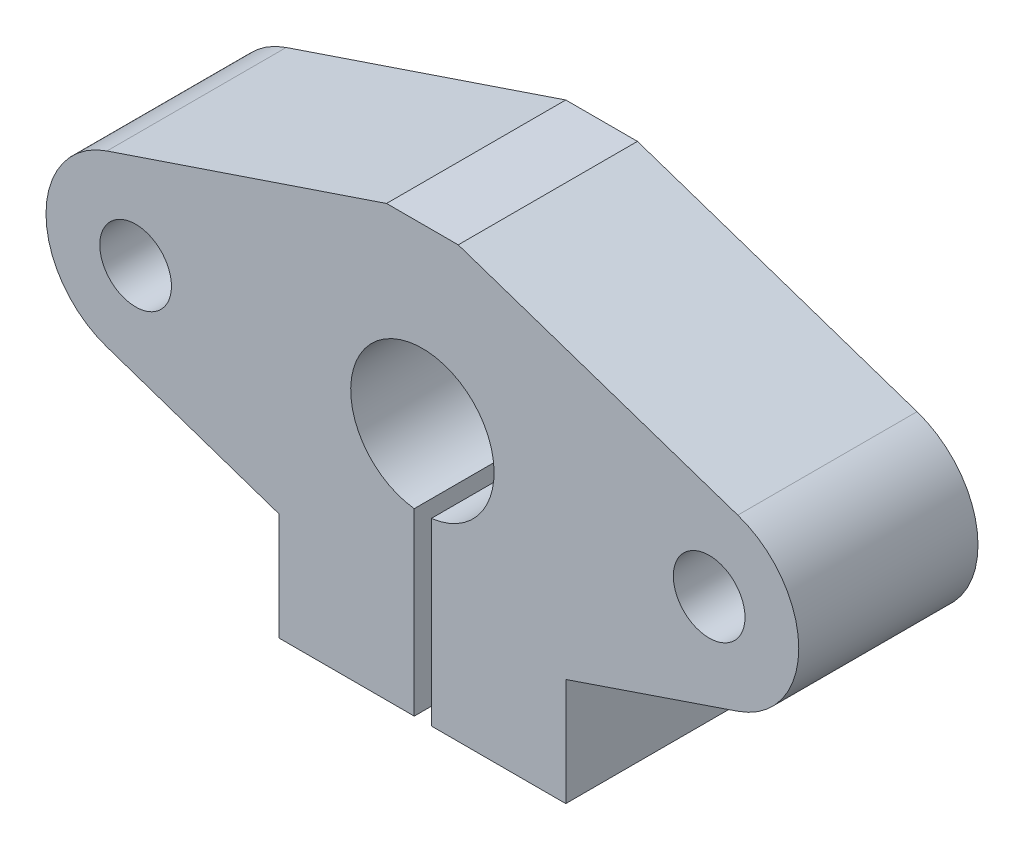
ISO-10303-21;
HEADER;
FILE_DESCRIPTION(('STEP AP214'),'2;1');
FILE_NAME('part.step','',(''),(''),'','','');
FILE_SCHEMA(('AUTOMOTIVE_DESIGN { 1 0 10303 214 1 1 1 1 }'));
ENDSEC;
DATA;
#1=APPLICATION_CONTEXT('core data for automotive mechanical design processes');
#2=APPLICATION_PROTOCOL_DEFINITION('international standard','automotive_design',2000,#1);
#3=PRODUCT_CONTEXT('',#1,'mechanical');
#4=PRODUCT('Part','Part','',(#3));
#5=PRODUCT_RELATED_PRODUCT_CATEGORY('part','',(#4));
#6=PRODUCT_DEFINITION_FORMATION('','',#4);
#7=PRODUCT_DEFINITION_CONTEXT('part definition',#1,'design');
#8=PRODUCT_DEFINITION('design','',#6,#7);
#9=PRODUCT_DEFINITION_SHAPE('','',#8);
#10=(LENGTH_UNIT() NAMED_UNIT(*) SI_UNIT(.MILLI.,.METRE.));
#11=(NAMED_UNIT(*) PLANE_ANGLE_UNIT() SI_UNIT($,.RADIAN.));
#12=(NAMED_UNIT(*) SI_UNIT($,.STERADIAN.) SOLID_ANGLE_UNIT());
#13=UNCERTAINTY_MEASURE_WITH_UNIT(LENGTH_MEASURE(1.E-05),#10,'distance_accuracy_value','');
#14=(GEOMETRIC_REPRESENTATION_CONTEXT(3) GLOBAL_UNCERTAINTY_ASSIGNED_CONTEXT((#13)) GLOBAL_UNIT_ASSIGNED_CONTEXT((#10,
#11,#12)) REPRESENTATION_CONTEXT('',''));
#15=CARTESIAN_POINT('',(0.,0.,0.));
#16=DIRECTION('',(0.,0.,1.));
#17=DIRECTION('',(1.,0.,0.));
#18=AXIS2_PLACEMENT_3D('',#15,#16,#17);
#19=CARTESIAN_POINT('',(0.,-2.00000002980232,0.));
#20=DIRECTION('',(0.,0.,1.));
#21=DIRECTION('',(1.,0.,0.));
#22=AXIS2_PLACEMENT_3D('',#19,#20,#21);
#23=PLANE('',#22);
#24=CARTESIAN_POINT('',(-16.0000002384186,0.,0.));
#25=DIRECTION('',(0.,0.,1.));
#26=DIRECTION('',(1.,0.,0.));
#27=AXIS2_PLACEMENT_3D('',#24,#25,#26);
#28=CIRCLE('',#27,2.);
#29=CARTESIAN_POINT('',(-14.0000002384186,0.,0.));
#30=VERTEX_POINT('',#29);
#31=EDGE_CURVE('E277',#30,#30,#28,.T.);
#32=ORIENTED_EDGE('',*,*,#31,.T.);
#33=EDGE_LOOP('',(#32));
#34=FACE_BOUND('',#33,.T.);
#35=CARTESIAN_POINT('',(16.0000002384186,0.,0.));
#36=DIRECTION('',(0.,0.,1.));
#37=DIRECTION('',(1.,0.,0.));
#38=AXIS2_PLACEMENT_3D('',#35,#36,#37);
#39=CIRCLE('',#38,2.);
#40=CARTESIAN_POINT('',(18.0000002384186,0.,0.));
#41=VERTEX_POINT('',#40);
#42=EDGE_CURVE('E280',#41,#41,#39,.T.);
#43=ORIENTED_EDGE('',*,*,#42,.T.);
#44=EDGE_LOOP('',(#43));
#45=FACE_BOUND('',#44,.T.);
#46=CARTESIAN_POINT('',(0.,0.,0.));
#47=DIRECTION('',(0.,0.,1.));
#48=DIRECTION('',(1.,0.,0.));
#49=AXIS2_PLACEMENT_3D('',#46,#47,#48);
#50=CIRCLE('',#49,4.);
#51=CARTESIAN_POINT('',(0.500000007450581,-3.9686269656582,0.));
#52=VERTEX_POINT('',#51);
#53=CARTESIAN_POINT('',(-0.454029145374788,-3.97414865539152,0.));
#54=VERTEX_POINT('',#53);
#55=EDGE_CURVE('E283',#52,#54,#50,.T.);
#56=ORIENTED_EDGE('',*,*,#55,.T.);
#57=DIRECTION('',(0.,1.,0.));
#58=VECTOR('',#57,1.);
#59=CARTESIAN_POINT('',(-0.454029145374788,-14.0000002086163,0.));
#60=LINE('',#59,#58);
#61=CARTESIAN_POINT('',(-0.454029145374788,-14.0000002086163,0.));
#62=VERTEX_POINT('',#61);
#63=EDGE_CURVE('E145',#62,#54,#60,.T.);
#64=ORIENTED_EDGE('',*,*,#63,.F.);
#65=DIRECTION('',(1.,0.,0.));
#66=VECTOR('',#65,1.);
#67=CARTESIAN_POINT('',(-8.00000011920929,-14.0000002086163,0.));
#68=LINE('',#67,#66);
#69=CARTESIAN_POINT('',(-8.00000011920929,-14.0000002086163,0.));
#70=VERTEX_POINT('',#69);
#71=EDGE_CURVE('E146',#70,#62,#68,.T.);
#72=ORIENTED_EDGE('',*,*,#71,.F.);
#73=DIRECTION('',(0.,1.,0.));
#74=VECTOR('',#73,1.);
#75=CARTESIAN_POINT('',(-8.00000011920929,-8.00000011920929,0.));
#76=LINE('',#75,#74);
#77=CARTESIAN_POINT('',(-8.00000011920929,-8.00000011920929,0.));
#78=VERTEX_POINT('',#77);
#79=EDGE_CURVE('E142',#78,#70,#76,.F.);
#80=ORIENTED_EDGE('',*,*,#79,.F.);
#81=DIRECTION('',(0.946805720455799,-0.321805729769025,0.));
#82=VECTOR('',#81,1.);
#83=CARTESIAN_POINT('',(-17.6090288872637,-4.734028602279,0.));
#84=LINE('',#83,#82);
#85=CARTESIAN_POINT('',(-17.6090288872637,-4.734028602279,0.));
#86=VERTEX_POINT('',#85);
#87=EDGE_CURVE('E176',#86,#78,#84,.T.);
#88=ORIENTED_EDGE('',*,*,#87,.F.);
#89=CARTESIAN_POINT('',(-16.0000002384186,0.,0.));
#90=DIRECTION('',(0.,0.,1.));
#91=DIRECTION('',(1.,0.,0.));
#92=AXIS2_PLACEMENT_3D('',#89,#90,#91);
#93=CIRCLE('',#92,5.);
#94=CARTESIAN_POINT('',(-17.5983241843801,4.73765348709316,0.));
#95=VERTEX_POINT('',#94);
#96=EDGE_CURVE('E180',#95,#86,#93,.T.);
#97=ORIENTED_EDGE('',*,*,#96,.F.);
#98=DIRECTION('',(-0.947530697418635,-0.319664789192297,0.));
#99=VECTOR('',#98,1.);
#100=CARTESIAN_POINT('',(-2.00000002980232,10.0000001490116,0.));
#101=LINE('',#100,#99);
#102=CARTESIAN_POINT('',(-2.00000002980232,10.0000001490116,0.));
#103=VERTEX_POINT('',#102);
#104=EDGE_CURVE('E184',#103,#95,#101,.T.);
#105=ORIENTED_EDGE('',*,*,#104,.F.);
#106=DIRECTION('',(1.,0.,0.));
#107=VECTOR('',#106,1.);
#108=CARTESIAN_POINT('',(2.00000002980232,10.0000001490116,0.));
#109=LINE('',#108,#107);
#110=CARTESIAN_POINT('',(2.00000002980232,10.0000001490116,0.));
#111=VERTEX_POINT('',#110);
#112=EDGE_CURVE('E197',#111,#103,#109,.F.);
#113=ORIENTED_EDGE('',*,*,#112,.F.);
#114=DIRECTION('',(-0.947530697418635,0.319664789192297,0.));
#115=VECTOR('',#114,1.);
#116=CARTESIAN_POINT('',(17.5983241843801,4.73765348709317,0.));
#117=LINE('',#116,#115);
#118=CARTESIAN_POINT('',(17.5983241843801,4.73765348709317,0.));
#119=VERTEX_POINT('',#118);
#120=EDGE_CURVE('E203',#119,#111,#117,.T.);
#121=ORIENTED_EDGE('',*,*,#120,.F.);
#122=CARTESIAN_POINT('',(16.0000002384186,0.,0.));
#123=DIRECTION('',(0.,0.,1.));
#124=DIRECTION('',(1.,0.,0.));
#125=AXIS2_PLACEMENT_3D('',#122,#123,#124);
#126=CIRCLE('',#125,5.);
#127=CARTESIAN_POINT('',(17.6090288872637,-4.734028602279,0.));
#128=VERTEX_POINT('',#127);
#129=EDGE_CURVE('E20',#128,#119,#126,.T.);
#130=ORIENTED_EDGE('',*,*,#129,.F.);
#131=DIRECTION('',(0.946805720455799,0.321805729769025,0.));
#132=VECTOR('',#131,1.);
#133=CARTESIAN_POINT('',(8.00000011920929,-8.00000011920929,0.));
#134=LINE('',#133,#132);
#135=CARTESIAN_POINT('',(8.00000011920929,-8.00000011920929,0.));
#136=VERTEX_POINT('',#135);
#137=EDGE_CURVE('E89',#136,#128,#134,.T.);
#138=ORIENTED_EDGE('',*,*,#137,.F.);
#139=DIRECTION('',(0.,1.,0.));
#140=VECTOR('',#139,1.);
#141=CARTESIAN_POINT('',(8.00000011920929,-14.0000002086163,0.));
#142=LINE('',#141,#140);
#143=CARTESIAN_POINT('',(8.00000011920929,-14.0000002086163,0.));
#144=VERTEX_POINT('',#143);
#145=EDGE_CURVE('E218',#144,#136,#142,.T.);
#146=ORIENTED_EDGE('',*,*,#145,.F.);
#147=DIRECTION('',(1.,0.,0.));
#148=VECTOR('',#147,1.);
#149=CARTESIAN_POINT('',(0.500000007450581,-14.0000002086163,0.));
#150=LINE('',#149,#148);
#151=CARTESIAN_POINT('',(0.500000007450581,-14.0000002086163,0.));
#152=VERTEX_POINT('',#151);
#153=EDGE_CURVE('E227',#152,#144,#150,.T.);
#154=ORIENTED_EDGE('',*,*,#153,.F.);
#155=DIRECTION('',(0.,1.,0.));
#156=VECTOR('',#155,1.);
#157=CARTESIAN_POINT('',(0.500000007450581,-3.9686269656582,0.));
#158=LINE('',#157,#156);
#159=EDGE_CURVE('E230',#52,#152,#158,.F.);
#160=ORIENTED_EDGE('',*,*,#159,.F.);
#161=EDGE_LOOP('',(#56,#64,#72,#80,#88,#97,#105,#113,#121,#130,#138,#146,#154,#160));
#162=FACE_BOUND('',#161,.T.);
#163=ADVANCED_FACE('F17',(#34,#45,#162),#23,.F.);
#164=CARTESIAN_POINT('',(0.500000007450581,-3.9686269656582,0.));
#165=DIRECTION('',(-1.,0.,0.));
#166=DIRECTION('',(0.,0.,1.));
#167=AXIS2_PLACEMENT_3D('',#164,#165,#166);
#168=PLANE('',#167);
#169=DIRECTION('',(0.,1.,0.));
#170=VECTOR('',#169,1.);
#171=CARTESIAN_POINT('',(0.500000007450581,-2.00000002980232,10.));
#172=LINE('',#171,#170);
#173=CARTESIAN_POINT('',(0.500000007450581,-3.9686269656582,10.));
#174=VERTEX_POINT('',#173);
#175=CARTESIAN_POINT('',(0.500000007450581,-14.0000002086163,10.));
#176=VERTEX_POINT('',#175);
#177=EDGE_CURVE('E223',#174,#176,#172,.F.);
#178=ORIENTED_EDGE('',*,*,#177,.F.);
#179=DIRECTION('',(0.,0.,1.));
#180=VECTOR('',#179,1.);
#181=CARTESIAN_POINT('',(0.500000007450582,-3.9686269656582,0.));
#182=LINE('',#181,#180);
#183=EDGE_CURVE('E285',#174,#52,#182,.F.);
#184=ORIENTED_EDGE('',*,*,#183,.T.);
#185=ORIENTED_EDGE('',*,*,#159,.T.);
#186=DIRECTION('',(0.,0.,-1.));
#187=VECTOR('',#186,1.);
#188=CARTESIAN_POINT('',(0.500000007450581,-14.0000002086163,0.));
#189=LINE('',#188,#187);
#190=EDGE_CURVE('E99',#176,#152,#189,.T.);
#191=ORIENTED_EDGE('',*,*,#190,.F.);
#192=EDGE_LOOP('',(#178,#184,#185,#191));
#193=FACE_BOUND('',#192,.T.);
#194=ADVANCED_FACE('F329',(#193),#168,.T.);
#195=CARTESIAN_POINT('',(0.500000007450581,-14.0000002086163,0.));
#196=DIRECTION('',(0.,-1.,0.));
#197=DIRECTION('',(0.,0.,-1.));
#198=AXIS2_PLACEMENT_3D('',#195,#196,#197);
#199=PLANE('',#198);
#200=DIRECTION('',(1.,0.,0.));
#201=VECTOR('',#200,1.);
#202=CARTESIAN_POINT('',(0.,-14.0000002086163,10.));
#203=LINE('',#202,#201);
#204=CARTESIAN_POINT('',(8.00000011920929,-14.0000002086163,10.));
#205=VERTEX_POINT('',#204);
#206=EDGE_CURVE('E214',#176,#205,#203,.T.);
#207=ORIENTED_EDGE('',*,*,#206,.F.);
#208=ORIENTED_EDGE('',*,*,#190,.T.);
#209=ORIENTED_EDGE('',*,*,#153,.T.);
#210=DIRECTION('',(0.,0.,-1.));
#211=VECTOR('',#210,1.);
#212=CARTESIAN_POINT('',(8.00000011920929,-14.0000002086163,0.));
#213=LINE('',#212,#211);
#214=EDGE_CURVE('E105',#205,#144,#213,.T.);
#215=ORIENTED_EDGE('',*,*,#214,.F.);
#216=EDGE_LOOP('',(#207,#208,#209,#215));
#217=FACE_BOUND('',#216,.T.);
#218=ADVANCED_FACE('F331',(#217),#199,.T.);
#219=CARTESIAN_POINT('',(8.00000011920929,-14.0000002086163,0.));
#220=DIRECTION('',(1.,0.,0.));
#221=DIRECTION('',(0.,0.,-1.));
#222=AXIS2_PLACEMENT_3D('',#219,#220,#221);
#223=PLANE('',#222);
#224=DIRECTION('',(0.,1.,0.));
#225=VECTOR('',#224,1.);
#226=CARTESIAN_POINT('',(8.00000011920929,-2.00000002980232,10.));
#227=LINE('',#226,#225);
#228=CARTESIAN_POINT('',(8.00000011920929,-8.00000011920929,10.));
#229=VERTEX_POINT('',#228);
#230=EDGE_CURVE('E210',#205,#229,#227,.T.);
#231=ORIENTED_EDGE('',*,*,#230,.F.);
#232=ORIENTED_EDGE('',*,*,#214,.T.);
#233=ORIENTED_EDGE('',*,*,#145,.T.);
#234=DIRECTION('',(0.,0.,1.));
#235=VECTOR('',#234,1.);
#236=CARTESIAN_POINT('',(8.00000011920929,-8.00000011920929,0.));
#237=LINE('',#236,#235);
#238=EDGE_CURVE('E110',#229,#136,#237,.F.);
#239=ORIENTED_EDGE('',*,*,#238,.F.);
#240=EDGE_LOOP('',(#231,#232,#233,#239));
#241=FACE_BOUND('',#240,.T.);
#242=ADVANCED_FACE('F332',(#241),#223,.T.);
#243=CARTESIAN_POINT('',(8.00000011920929,-8.00000011920929,0.));
#244=DIRECTION('',(0.321805729769025,-0.946805720455799,0.));
#245=DIRECTION('',(0.946805720455799,0.321805729769025,0.));
#246=AXIS2_PLACEMENT_3D('',#243,#244,#245);
#247=PLANE('',#246);
#248=DIRECTION('',(0.946805720455799,0.321805729769025,0.));
#249=VECTOR('',#248,1.);
#250=CARTESIAN_POINT('',(8.00000011920929,-8.00000011920929,10.));
#251=LINE('',#250,#249);
#252=CARTESIAN_POINT('',(17.6090288872637,-4.734028602279,10.));
#253=VERTEX_POINT('',#252);
#254=EDGE_CURVE('E213',#229,#253,#251,.T.);
#255=ORIENTED_EDGE('',*,*,#254,.F.);
#256=ORIENTED_EDGE('',*,*,#238,.T.);
#257=ORIENTED_EDGE('',*,*,#137,.T.);
#258=DIRECTION('',(0.,0.,1.));
#259=VECTOR('',#258,1.);
#260=CARTESIAN_POINT('',(17.6090288872637,-4.73402860227901,0.));
#261=LINE('',#260,#259);
#262=EDGE_CURVE('E204',#253,#128,#261,.F.);
#263=ORIENTED_EDGE('',*,*,#262,.F.);
#264=EDGE_LOOP('',(#255,#256,#257,#263));
#265=FACE_BOUND('',#264,.T.);
#266=ADVANCED_FACE('F334',(#265),#247,.T.);
#267=CARTESIAN_POINT('',(16.0000002384186,0.,0.));
#268=DIRECTION('',(0.,0.,1.));
#269=DIRECTION('',(1.,0.,0.));
#270=AXIS2_PLACEMENT_3D('',#267,#268,#269);
#271=CYLINDRICAL_SURFACE('',#270,5.);
#272=CARTESIAN_POINT('',(16.0000002384186,0.,10.));
#273=DIRECTION('',(0.,0.,1.));
#274=DIRECTION('',(1.,0.,0.));
#275=AXIS2_PLACEMENT_3D('',#272,#273,#274);
#276=CIRCLE('',#275,5.);
#277=CARTESIAN_POINT('',(17.5983241843801,4.73765348709317,10.));
#278=VERTEX_POINT('',#277);
#279=EDGE_CURVE('E274',#253,#278,#276,.T.);
#280=ORIENTED_EDGE('',*,*,#279,.F.);
#281=ORIENTED_EDGE('',*,*,#262,.T.);
#282=ORIENTED_EDGE('',*,*,#129,.T.);
#283=DIRECTION('',(0.,0.,1.));
#284=VECTOR('',#283,1.);
#285=CARTESIAN_POINT('',(17.5983241843801,4.73765348709317,0.));
#286=LINE('',#285,#284);
#287=EDGE_CURVE('E200',#278,#119,#286,.F.);
#288=ORIENTED_EDGE('',*,*,#287,.F.);
#289=EDGE_LOOP('',(#280,#281,#282,#288));
#290=FACE_BOUND('',#289,.T.);
#291=ADVANCED_FACE('F337',(#290),#271,.T.);
#292=CARTESIAN_POINT('',(17.5983241843801,4.73765348709317,0.));
#293=DIRECTION('',(0.319664789192297,0.947530697418635,0.));
#294=DIRECTION('',(-0.947530697418635,0.319664789192297,0.));
#295=AXIS2_PLACEMENT_3D('',#292,#293,#294);
#296=PLANE('',#295);
#297=DIRECTION('',(-0.947530697418635,0.319664789192296,0.));
#298=VECTOR('',#297,1.);
#299=CARTESIAN_POINT('',(17.5983241843801,4.73765348709317,10.));
#300=LINE('',#299,#298);
#301=CARTESIAN_POINT('',(2.00000002980232,10.0000001490116,10.));
#302=VERTEX_POINT('',#301);
#303=EDGE_CURVE('E191',#278,#302,#300,.T.);
#304=ORIENTED_EDGE('',*,*,#303,.F.);
#305=ORIENTED_EDGE('',*,*,#287,.T.);
#306=ORIENTED_EDGE('',*,*,#120,.T.);
#307=DIRECTION('',(0.,0.,1.));
#308=VECTOR('',#307,1.);
#309=CARTESIAN_POINT('',(2.00000002980232,10.0000001490116,0.));
#310=LINE('',#309,#308);
#311=EDGE_CURVE('E194',#302,#111,#310,.F.);
#312=ORIENTED_EDGE('',*,*,#311,.F.);
#313=EDGE_LOOP('',(#304,#305,#306,#312));
#314=FACE_BOUND('',#313,.T.);
#315=ADVANCED_FACE('F340',(#314),#296,.T.);
#316=CARTESIAN_POINT('',(2.00000002980232,10.0000001490116,0.));
#317=DIRECTION('',(0.,1.,0.));
#318=DIRECTION('',(0.,0.,1.));
#319=AXIS2_PLACEMENT_3D('',#316,#317,#318);
#320=PLANE('',#319);
#321=DIRECTION('',(1.,0.,0.));
#322=VECTOR('',#321,1.);
#323=CARTESIAN_POINT('',(0.,10.0000001490116,10.));
#324=LINE('',#323,#322);
#325=CARTESIAN_POINT('',(-2.00000002980232,10.0000001490116,10.));
#326=VERTEX_POINT('',#325);
#327=EDGE_CURVE('E187',#302,#326,#324,.F.);
#328=ORIENTED_EDGE('',*,*,#327,.F.);
#329=ORIENTED_EDGE('',*,*,#311,.T.);
#330=ORIENTED_EDGE('',*,*,#112,.T.);
#331=DIRECTION('',(0.,0.,1.));
#332=VECTOR('',#331,1.);
#333=CARTESIAN_POINT('',(-2.00000002980232,10.0000001490116,0.));
#334=LINE('',#333,#332);
#335=EDGE_CURVE('E181',#326,#103,#334,.F.);
#336=ORIENTED_EDGE('',*,*,#335,.F.);
#337=EDGE_LOOP('',(#328,#329,#330,#336));
#338=FACE_BOUND('',#337,.T.);
#339=ADVANCED_FACE('F342',(#338),#320,.T.);
#340=CARTESIAN_POINT('',(-2.00000002980232,10.0000001490116,0.));
#341=DIRECTION('',(-0.319664789192297,0.947530697418635,0.));
#342=DIRECTION('',(-0.947530697418635,-0.319664789192297,0.));
#343=AXIS2_PLACEMENT_3D('',#340,#341,#342);
#344=PLANE('',#343);
#345=DIRECTION('',(-0.947530697418635,-0.319664789192296,0.));
#346=VECTOR('',#345,1.);
#347=CARTESIAN_POINT('',(-2.00000002980232,10.0000001490116,10.));
#348=LINE('',#347,#346);
#349=CARTESIAN_POINT('',(-17.5983241843801,4.73765348709317,10.));
#350=VERTEX_POINT('',#349);
#351=EDGE_CURVE('E190',#326,#350,#348,.T.);
#352=ORIENTED_EDGE('',*,*,#351,.F.);
#353=ORIENTED_EDGE('',*,*,#335,.T.);
#354=ORIENTED_EDGE('',*,*,#104,.T.);
#355=DIRECTION('',(0.,0.,1.));
#356=VECTOR('',#355,1.);
#357=CARTESIAN_POINT('',(-17.5983241843801,4.73765348709317,0.));
#358=LINE('',#357,#356);
#359=EDGE_CURVE('E177',#350,#95,#358,.F.);
#360=ORIENTED_EDGE('',*,*,#359,.F.);
#361=EDGE_LOOP('',(#352,#353,#354,#360));
#362=FACE_BOUND('',#361,.T.);
#363=ADVANCED_FACE('F343',(#362),#344,.T.);
#364=CARTESIAN_POINT('',(-16.0000002384186,0.,0.));
#365=DIRECTION('',(0.,0.,1.));
#366=DIRECTION('',(1.,0.,0.));
#367=AXIS2_PLACEMENT_3D('',#364,#365,#366);
#368=CYLINDRICAL_SURFACE('',#367,5.);
#369=CARTESIAN_POINT('',(-16.0000002384186,0.,10.));
#370=DIRECTION('',(0.,0.,1.));
#371=DIRECTION('',(1.,0.,0.));
#372=AXIS2_PLACEMENT_3D('',#369,#370,#371);
#373=CIRCLE('',#372,5.);
#374=CARTESIAN_POINT('',(-17.6090288872637,-4.734028602279,10.));
#375=VERTEX_POINT('',#374);
#376=EDGE_CURVE('E162',#350,#375,#373,.T.);
#377=ORIENTED_EDGE('',*,*,#376,.F.);
#378=ORIENTED_EDGE('',*,*,#359,.T.);
#379=ORIENTED_EDGE('',*,*,#96,.T.);
#380=DIRECTION('',(0.,0.,1.));
#381=VECTOR('',#380,1.);
#382=CARTESIAN_POINT('',(-17.6090288872637,-4.734028602279,0.));
#383=LINE('',#382,#381);
#384=EDGE_CURVE('E173',#375,#86,#383,.F.);
#385=ORIENTED_EDGE('',*,*,#384,.F.);
#386=EDGE_LOOP('',(#377,#378,#379,#385));
#387=FACE_BOUND('',#386,.T.);
#388=ADVANCED_FACE('F289',(#387),#368,.T.);
#389=CARTESIAN_POINT('',(-17.6090288872637,-4.734028602279,0.));
#390=DIRECTION('',(-0.321805729769025,-0.946805720455799,0.));
#391=DIRECTION('',(0.946805720455799,-0.321805729769025,0.));
#392=AXIS2_PLACEMENT_3D('',#389,#390,#391);
#393=PLANE('',#392);
#394=DIRECTION('',(0.946805720455799,-0.321805729769025,0.));
#395=VECTOR('',#394,1.);
#396=CARTESIAN_POINT('',(-17.6090288872637,-4.734028602279,10.));
#397=LINE('',#396,#395);
#398=CARTESIAN_POINT('',(-8.00000011920929,-8.00000011920929,10.));
#399=VERTEX_POINT('',#398);
#400=EDGE_CURVE('E160',#375,#399,#397,.T.);
#401=ORIENTED_EDGE('',*,*,#400,.F.);
#402=ORIENTED_EDGE('',*,*,#384,.T.);
#403=ORIENTED_EDGE('',*,*,#87,.T.);
#404=DIRECTION('',(0.,0.,1.));
#405=VECTOR('',#404,1.);
#406=CARTESIAN_POINT('',(-8.00000011920929,-8.00000011920929,0.));
#407=LINE('',#406,#405);
#408=EDGE_CURVE('E169',#399,#78,#407,.F.);
#409=ORIENTED_EDGE('',*,*,#408,.F.);
#410=EDGE_LOOP('',(#401,#402,#403,#409));
#411=FACE_BOUND('',#410,.T.);
#412=ADVANCED_FACE('F291',(#411),#393,.T.);
#413=CARTESIAN_POINT('',(-8.00000011920929,-8.00000011920929,0.));
#414=DIRECTION('',(-1.,0.,0.));
#415=DIRECTION('',(0.,0.,1.));
#416=AXIS2_PLACEMENT_3D('',#413,#414,#415);
#417=PLANE('',#416);
#418=DIRECTION('',(0.,1.,0.));
#419=VECTOR('',#418,1.);
#420=CARTESIAN_POINT('',(-8.00000011920929,-2.00000002980232,10.));
#421=LINE('',#420,#419);
#422=CARTESIAN_POINT('',(-8.00000011920929,-14.0000002086163,10.));
#423=VERTEX_POINT('',#422);
#424=EDGE_CURVE('E140',#399,#423,#421,.F.);
#425=ORIENTED_EDGE('',*,*,#424,.F.);
#426=ORIENTED_EDGE('',*,*,#408,.T.);
#427=ORIENTED_EDGE('',*,*,#79,.T.);
#428=DIRECTION('',(0.,0.,-1.));
#429=VECTOR('',#428,1.);
#430=CARTESIAN_POINT('',(-8.00000011920929,-14.0000002086163,0.));
#431=LINE('',#430,#429);
#432=EDGE_CURVE('E135',#423,#70,#431,.T.);
#433=ORIENTED_EDGE('',*,*,#432,.F.);
#434=EDGE_LOOP('',(#425,#426,#427,#433));
#435=FACE_BOUND('',#434,.T.);
#436=ADVANCED_FACE('F137',(#435),#417,.T.);
#437=CARTESIAN_POINT('',(-8.00000011920929,-14.0000002086163,0.));
#438=DIRECTION('',(0.,-1.,0.));
#439=DIRECTION('',(0.,0.,-1.));
#440=AXIS2_PLACEMENT_3D('',#437,#438,#439);
#441=PLANE('',#440);
#442=DIRECTION('',(1.,0.,0.));
#443=VECTOR('',#442,1.);
#444=CARTESIAN_POINT('',(0.,-14.0000002086163,10.));
#445=LINE('',#444,#443);
#446=CARTESIAN_POINT('',(-0.454029145374788,-14.0000002086163,10.));
#447=VERTEX_POINT('',#446);
#448=EDGE_CURVE('E149',#423,#447,#445,.T.);
#449=ORIENTED_EDGE('',*,*,#448,.F.);
#450=ORIENTED_EDGE('',*,*,#432,.T.);
#451=ORIENTED_EDGE('',*,*,#71,.T.);
#452=DIRECTION('',(0.,0.,-1.));
#453=VECTOR('',#452,1.);
#454=CARTESIAN_POINT('',(-0.454029145374788,-14.0000002086163,0.));
#455=LINE('',#454,#453);
#456=EDGE_CURVE('E152',#447,#62,#455,.T.);
#457=ORIENTED_EDGE('',*,*,#456,.F.);
#458=EDGE_LOOP('',(#449,#450,#451,#457));
#459=FACE_BOUND('',#458,.T.);
#460=ADVANCED_FACE('F150',(#459),#441,.T.);
#461=CARTESIAN_POINT('',(-0.454029145374788,-14.0000002086163,0.));
#462=DIRECTION('',(1.,0.,0.));
#463=DIRECTION('',(0.,0.,-1.));
#464=AXIS2_PLACEMENT_3D('',#461,#462,#463);
#465=PLANE('',#464);
#466=DIRECTION('',(0.,1.,0.));
#467=VECTOR('',#466,1.);
#468=CARTESIAN_POINT('',(-0.454029145374788,-2.00000002980232,10.));
#469=LINE('',#468,#467);
#470=CARTESIAN_POINT('',(-0.454029145374788,-3.97414865539152,10.));
#471=VERTEX_POINT('',#470);
#472=EDGE_CURVE('E155',#447,#471,#469,.T.);
#473=ORIENTED_EDGE('',*,*,#472,.F.);
#474=ORIENTED_EDGE('',*,*,#456,.T.);
#475=ORIENTED_EDGE('',*,*,#63,.T.);
#476=DIRECTION('',(0.,0.,1.));
#477=VECTOR('',#476,1.);
#478=CARTESIAN_POINT('',(-0.454029145374788,-3.97414865539152,0.));
#479=LINE('',#478,#477);
#480=EDGE_CURVE('E35',#54,#471,#479,.T.);
#481=ORIENTED_EDGE('',*,*,#480,.T.);
#482=EDGE_LOOP('',(#473,#474,#475,#481));
#483=FACE_BOUND('',#482,.T.);
#484=ADVANCED_FACE('F321',(#483),#465,.T.);
#485=CARTESIAN_POINT('',(0.,0.,0.));
#486=DIRECTION('',(0.,0.,1.));
#487=DIRECTION('',(1.,0.,0.));
#488=AXIS2_PLACEMENT_3D('',#485,#486,#487);
#489=CYLINDRICAL_SURFACE('',#488,4.);
#490=ORIENTED_EDGE('',*,*,#183,.F.);
#491=CARTESIAN_POINT('',(0.,0.,10.));
#492=DIRECTION('',(0.,0.,1.));
#493=DIRECTION('',(1.,0.,0.));
#494=AXIS2_PLACEMENT_3D('',#491,#492,#493);
#495=CIRCLE('',#494,4.);
#496=EDGE_CURVE('E270',#471,#174,#495,.F.);
#497=ORIENTED_EDGE('',*,*,#496,.F.);
#498=ORIENTED_EDGE('',*,*,#480,.F.);
#499=ORIENTED_EDGE('',*,*,#55,.F.);
#500=EDGE_LOOP('',(#490,#497,#498,#499));
#501=FACE_BOUND('',#500,.T.);
#502=ADVANCED_FACE('F327',(#501),#489,.F.);
#503=CARTESIAN_POINT('',(16.0000002384186,0.,0.));
#504=DIRECTION('',(0.,0.,1.));
#505=DIRECTION('',(1.,0.,0.));
#506=AXIS2_PLACEMENT_3D('',#503,#504,#505);
#507=CYLINDRICAL_SURFACE('',#506,2.);
#508=ORIENTED_EDGE('',*,*,#42,.F.);
#509=EDGE_LOOP('',(#508));
#510=FACE_BOUND('',#509,.T.);
#511=CARTESIAN_POINT('',(16.0000002384186,0.,10.));
#512=DIRECTION('',(0.,0.,1.));
#513=DIRECTION('',(1.,0.,0.));
#514=AXIS2_PLACEMENT_3D('',#511,#512,#513);
#515=CIRCLE('',#514,2.);
#516=CARTESIAN_POINT('',(18.0000002384186,0.,10.));
#517=VERTEX_POINT('',#516);
#518=EDGE_CURVE('E26',#517,#517,#515,.F.);
#519=ORIENTED_EDGE('',*,*,#518,.F.);
#520=EDGE_LOOP('',(#519));
#521=FACE_BOUND('',#520,.T.);
#522=ADVANCED_FACE('F358',(#510,#521),#507,.F.);
#523=CARTESIAN_POINT('',(-16.0000002384186,0.,0.));
#524=DIRECTION('',(0.,0.,1.));
#525=DIRECTION('',(1.,0.,0.));
#526=AXIS2_PLACEMENT_3D('',#523,#524,#525);
#527=CYLINDRICAL_SURFACE('',#526,2.);
#528=ORIENTED_EDGE('',*,*,#31,.F.);
#529=EDGE_LOOP('',(#528));
#530=FACE_BOUND('',#529,.T.);
#531=CARTESIAN_POINT('',(-16.0000002384186,0.,10.));
#532=DIRECTION('',(0.,0.,1.));
#533=DIRECTION('',(1.,0.,0.));
#534=AXIS2_PLACEMENT_3D('',#531,#532,#533);
#535=CIRCLE('',#534,2.);
#536=CARTESIAN_POINT('',(-14.0000002384186,0.,10.));
#537=VERTEX_POINT('',#536);
#538=EDGE_CURVE('E11',#537,#537,#535,.F.);
#539=ORIENTED_EDGE('',*,*,#538,.F.);
#540=EDGE_LOOP('',(#539));
#541=FACE_BOUND('',#540,.T.);
#542=ADVANCED_FACE('F352',(#530,#541),#527,.F.);
#543=CARTESIAN_POINT('',(0.,-2.00000002980232,10.));
#544=DIRECTION('',(0.,0.,1.));
#545=DIRECTION('',(1.,0.,0.));
#546=AXIS2_PLACEMENT_3D('',#543,#544,#545);
#547=PLANE('',#546);
#548=ORIENTED_EDGE('',*,*,#538,.T.);
#549=EDGE_LOOP('',(#548));
#550=FACE_BOUND('',#549,.T.);
#551=ORIENTED_EDGE('',*,*,#518,.T.);
#552=EDGE_LOOP('',(#551));
#553=FACE_BOUND('',#552,.T.);
#554=ORIENTED_EDGE('',*,*,#472,.T.);
#555=ORIENTED_EDGE('',*,*,#496,.T.);
#556=ORIENTED_EDGE('',*,*,#177,.T.);
#557=ORIENTED_EDGE('',*,*,#206,.T.);
#558=ORIENTED_EDGE('',*,*,#230,.T.);
#559=ORIENTED_EDGE('',*,*,#254,.T.);
#560=ORIENTED_EDGE('',*,*,#279,.T.);
#561=ORIENTED_EDGE('',*,*,#303,.T.);
#562=ORIENTED_EDGE('',*,*,#327,.T.);
#563=ORIENTED_EDGE('',*,*,#351,.T.);
#564=ORIENTED_EDGE('',*,*,#376,.T.);
#565=ORIENTED_EDGE('',*,*,#400,.T.);
#566=ORIENTED_EDGE('',*,*,#424,.T.);
#567=ORIENTED_EDGE('',*,*,#448,.T.);
#568=EDGE_LOOP('',(#554,#555,#556,#557,#558,#559,#560,#561,#562,#563,#564,#565,#566,#567));
#569=FACE_BOUND('',#568,.T.);
#570=ADVANCED_FACE('F157',(#550,#553,#569),#547,.T.);
#571=CLOSED_SHELL('',(#163,#194,#218,#242,#266,#291,#315,#339,#363,#388,#412,#436,#460,#484,
#502,#522,#542,#570));
#572=MANIFOLD_SOLID_BREP('B1',#571);
#573=ADVANCED_BREP_SHAPE_REPRESENTATION('',(#18,#572),#14);
#574=SHAPE_DEFINITION_REPRESENTATION(#9,#573);
ENDSEC;
END-ISO-10303-21;
